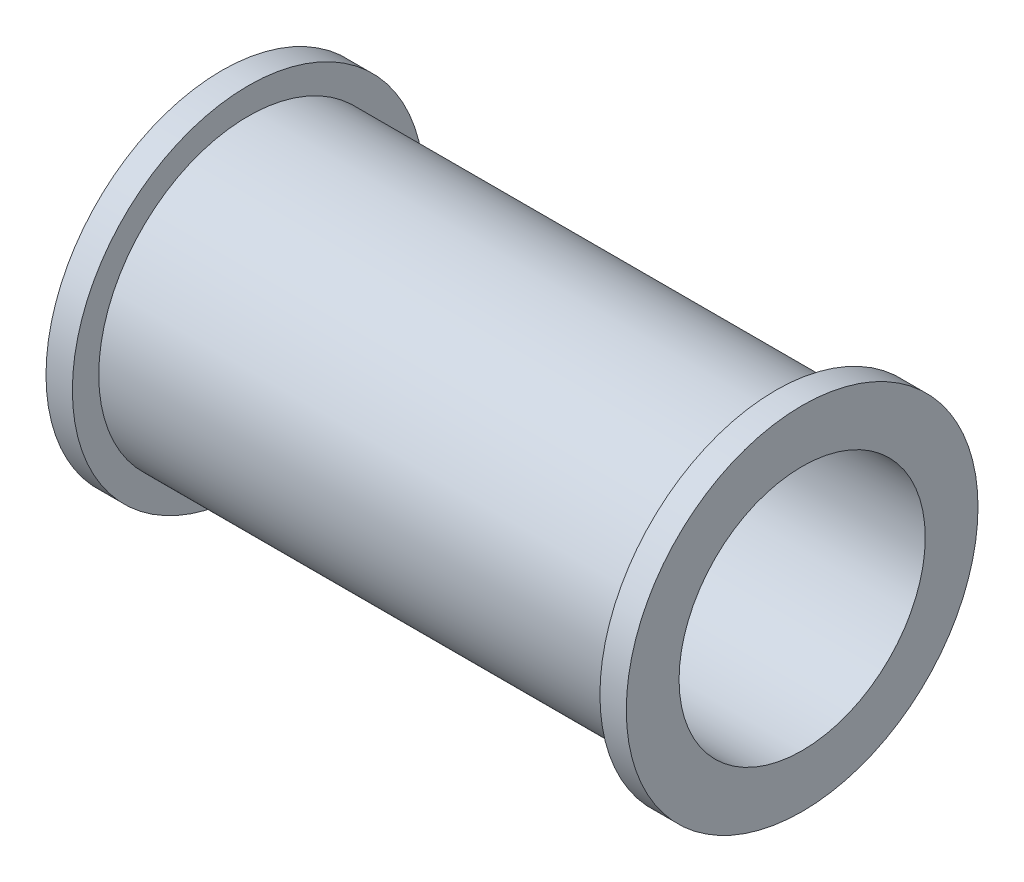
ISO-10303-21;
HEADER;
FILE_DESCRIPTION(('STEP AP214'),'2;1');
FILE_NAME('part.step','',(''),(''),'','','');
FILE_SCHEMA(('AUTOMOTIVE_DESIGN { 1 0 10303 214 1 1 1 1 }'));
ENDSEC;
DATA;
#1=APPLICATION_CONTEXT('core data for automotive mechanical design processes');
#2=APPLICATION_PROTOCOL_DEFINITION('international standard','automotive_design',2000,#1);
#3=PRODUCT_CONTEXT('',#1,'mechanical');
#4=PRODUCT('Part','Part','',(#3));
#5=PRODUCT_RELATED_PRODUCT_CATEGORY('part','',(#4));
#6=PRODUCT_DEFINITION_FORMATION('','',#4);
#7=PRODUCT_DEFINITION_CONTEXT('part definition',#1,'design');
#8=PRODUCT_DEFINITION('design','',#6,#7);
#9=PRODUCT_DEFINITION_SHAPE('','',#8);
#10=(LENGTH_UNIT() NAMED_UNIT(*) SI_UNIT(.MILLI.,.METRE.));
#11=(NAMED_UNIT(*) PLANE_ANGLE_UNIT() SI_UNIT($,.RADIAN.));
#12=(NAMED_UNIT(*) SI_UNIT($,.STERADIAN.) SOLID_ANGLE_UNIT());
#13=UNCERTAINTY_MEASURE_WITH_UNIT(LENGTH_MEASURE(1.E-05),#10,'distance_accuracy_value','');
#14=(GEOMETRIC_REPRESENTATION_CONTEXT(3) GLOBAL_UNCERTAINTY_ASSIGNED_CONTEXT((#13)) GLOBAL_UNIT_ASSIGNED_CONTEXT((#10,
#11,#12)) REPRESENTATION_CONTEXT('',''));
#15=CARTESIAN_POINT('',(0.,0.,0.));
#16=DIRECTION('',(0.,0.,1.));
#17=DIRECTION('',(1.,0.,0.));
#18=AXIS2_PLACEMENT_3D('',#15,#16,#17);
#19=CARTESIAN_POINT('',(0.,0.,0.));
#20=DIRECTION('',(-1.,0.,0.));
#21=DIRECTION('',(0.,0.,1.));
#22=AXIS2_PLACEMENT_3D('',#19,#20,#21);
#23=PLANE('',#22);
#24=CARTESIAN_POINT('',(0.,0.,0.));
#25=DIRECTION('',(1.,0.,0.));
#26=DIRECTION('',(0.,0.,-1.));
#27=AXIS2_PLACEMENT_3D('',#24,#25,#26);
#28=CIRCLE('',#27,7.);
#29=CARTESIAN_POINT('',(0.,0.,-7.));
#30=VERTEX_POINT('',#29);
#31=EDGE_CURVE('E60',#30,#30,#28,.T.);
#32=ORIENTED_EDGE('',*,*,#31,.T.);
#33=EDGE_LOOP('',(#32));
#34=FACE_BOUND('',#33,.T.);
#35=CARTESIAN_POINT('',(0.,0.,0.));
#36=DIRECTION('',(1.,0.,0.));
#37=DIRECTION('',(0.,0.,-1.));
#38=AXIS2_PLACEMENT_3D('',#35,#36,#37);
#39=CIRCLE('',#38,10.);
#40=CARTESIAN_POINT('',(0.,0.,-10.));
#41=VERTEX_POINT('',#40);
#42=EDGE_CURVE('E10',#41,#41,#39,.T.);
#43=ORIENTED_EDGE('',*,*,#42,.F.);
#44=EDGE_LOOP('',(#43));
#45=FACE_BOUND('',#44,.T.);
#46=ADVANCED_FACE('F35',(#34,#45),#23,.T.);
#47=CARTESIAN_POINT('',(33.,0.,0.));
#48=DIRECTION('',(1.,0.,0.));
#49=DIRECTION('',(0.,0.,-1.));
#50=AXIS2_PLACEMENT_3D('',#47,#48,#49);
#51=CYLINDRICAL_SURFACE('',#50,10.);
#52=ORIENTED_EDGE('',*,*,#42,.T.);
#53=EDGE_LOOP('',(#52));
#54=FACE_BOUND('',#53,.T.);
#55=CARTESIAN_POINT('',(1.5,0.,0.));
#56=DIRECTION('',(1.,0.,0.));
#57=DIRECTION('',(0.,0.,-1.));
#58=AXIS2_PLACEMENT_3D('',#55,#56,#57);
#59=CIRCLE('',#58,10.);
#60=CARTESIAN_POINT('',(1.5,0.,-10.));
#61=VERTEX_POINT('',#60);
#62=EDGE_CURVE('E41',#61,#61,#59,.T.);
#63=ORIENTED_EDGE('',*,*,#62,.F.);
#64=EDGE_LOOP('',(#63));
#65=FACE_BOUND('',#64,.T.);
#66=ADVANCED_FACE('F93',(#54,#65),#51,.T.);
#67=CARTESIAN_POINT('',(1.5,0.,-10.));
#68=DIRECTION('',(1.,0.,0.));
#69=DIRECTION('',(0.,0.,-1.));
#70=AXIS2_PLACEMENT_3D('',#67,#68,#69);
#71=PLANE('',#70);
#72=ORIENTED_EDGE('',*,*,#62,.T.);
#73=EDGE_LOOP('',(#72));
#74=FACE_BOUND('',#73,.T.);
#75=CARTESIAN_POINT('',(1.5,0.,0.));
#76=DIRECTION('',(1.,0.,0.));
#77=DIRECTION('',(0.,0.,-1.));
#78=AXIS2_PLACEMENT_3D('',#75,#76,#77);
#79=CIRCLE('',#78,8.5);
#80=CARTESIAN_POINT('',(1.5,0.,-8.5));
#81=VERTEX_POINT('',#80);
#82=EDGE_CURVE('E45',#81,#81,#79,.T.);
#83=ORIENTED_EDGE('',*,*,#82,.F.);
#84=EDGE_LOOP('',(#83));
#85=FACE_BOUND('',#84,.T.);
#86=ADVANCED_FACE('F97',(#74,#85),#71,.T.);
#87=CARTESIAN_POINT('',(33.,0.,0.));
#88=DIRECTION('',(1.,0.,0.));
#89=DIRECTION('',(0.,0.,-1.));
#90=AXIS2_PLACEMENT_3D('',#87,#88,#89);
#91=CYLINDRICAL_SURFACE('',#90,8.5);
#92=ORIENTED_EDGE('',*,*,#82,.T.);
#93=EDGE_LOOP('',(#92));
#94=FACE_BOUND('',#93,.T.);
#95=CARTESIAN_POINT('',(31.5,0.,0.));
#96=DIRECTION('',(1.,0.,0.));
#97=DIRECTION('',(0.,0.,-1.));
#98=AXIS2_PLACEMENT_3D('',#95,#96,#97);
#99=CIRCLE('',#98,8.5);
#100=CARTESIAN_POINT('',(31.5,0.,-8.5));
#101=VERTEX_POINT('',#100);
#102=EDGE_CURVE('E49',#101,#101,#99,.T.);
#103=ORIENTED_EDGE('',*,*,#102,.F.);
#104=EDGE_LOOP('',(#103));
#105=FACE_BOUND('',#104,.T.);
#106=ADVANCED_FACE('F89',(#94,#105),#91,.T.);
#107=CARTESIAN_POINT('',(31.5,0.,-10.));
#108=DIRECTION('',(-1.,0.,0.));
#109=DIRECTION('',(0.,0.,1.));
#110=AXIS2_PLACEMENT_3D('',#107,#108,#109);
#111=PLANE('',#110);
#112=ORIENTED_EDGE('',*,*,#102,.T.);
#113=EDGE_LOOP('',(#112));
#114=FACE_BOUND('',#113,.T.);
#115=CARTESIAN_POINT('',(31.5,0.,0.));
#116=DIRECTION('',(1.,0.,0.));
#117=DIRECTION('',(0.,0.,-1.));
#118=AXIS2_PLACEMENT_3D('',#115,#116,#117);
#119=CIRCLE('',#118,10.);
#120=CARTESIAN_POINT('',(31.5,0.,-10.));
#121=VERTEX_POINT('',#120);
#122=EDGE_CURVE('E54',#121,#121,#119,.T.);
#123=ORIENTED_EDGE('',*,*,#122,.F.);
#124=EDGE_LOOP('',(#123));
#125=FACE_BOUND('',#124,.T.);
#126=ADVANCED_FACE('F83',(#114,#125),#111,.T.);
#127=CARTESIAN_POINT('',(33.,0.,0.));
#128=DIRECTION('',(1.,0.,0.));
#129=DIRECTION('',(0.,0.,-1.));
#130=AXIS2_PLACEMENT_3D('',#127,#128,#129);
#131=CYLINDRICAL_SURFACE('',#130,10.);
#132=ORIENTED_EDGE('',*,*,#122,.T.);
#133=EDGE_LOOP('',(#132));
#134=FACE_BOUND('',#133,.T.);
#135=CARTESIAN_POINT('',(33.,0.,0.));
#136=DIRECTION('',(1.,0.,0.));
#137=DIRECTION('',(0.,0.,-1.));
#138=AXIS2_PLACEMENT_3D('',#135,#136,#137);
#139=CIRCLE('',#138,10.);
#140=CARTESIAN_POINT('',(33.,0.,-10.));
#141=VERTEX_POINT('',#140);
#142=EDGE_CURVE('E57',#141,#141,#139,.T.);
#143=ORIENTED_EDGE('',*,*,#142,.F.);
#144=EDGE_LOOP('',(#143));
#145=FACE_BOUND('',#144,.T.);
#146=ADVANCED_FACE('F78',(#134,#145),#131,.T.);
#147=CARTESIAN_POINT('',(33.,0.,0.));
#148=DIRECTION('',(1.,0.,0.));
#149=DIRECTION('',(0.,0.,-1.));
#150=AXIS2_PLACEMENT_3D('',#147,#148,#149);
#151=PLANE('',#150);
#152=CARTESIAN_POINT('',(33.,0.,0.));
#153=DIRECTION('',(1.,0.,0.));
#154=DIRECTION('',(0.,0.,-1.));
#155=AXIS2_PLACEMENT_3D('',#152,#153,#154);
#156=CIRCLE('',#155,7.);
#157=CARTESIAN_POINT('',(33.,0.,-7.));
#158=VERTEX_POINT('',#157);
#159=EDGE_CURVE('E61',#158,#158,#156,.T.);
#160=ORIENTED_EDGE('',*,*,#159,.F.);
#161=EDGE_LOOP('',(#160));
#162=FACE_BOUND('',#161,.T.);
#163=ORIENTED_EDGE('',*,*,#142,.T.);
#164=EDGE_LOOP('',(#163));
#165=FACE_BOUND('',#164,.T.);
#166=ADVANCED_FACE('F72',(#162,#165),#151,.T.);
#167=CARTESIAN_POINT('',(0.,0.,0.));
#168=DIRECTION('',(1.,0.,0.));
#169=DIRECTION('',(0.,0.,-1.));
#170=AXIS2_PLACEMENT_3D('',#167,#168,#169);
#171=CYLINDRICAL_SURFACE('',#170,7.);
#172=ORIENTED_EDGE('',*,*,#31,.F.);
#173=EDGE_LOOP('',(#172));
#174=FACE_BOUND('',#173,.T.);
#175=ORIENTED_EDGE('',*,*,#159,.T.);
#176=EDGE_LOOP('',(#175));
#177=FACE_BOUND('',#176,.T.);
#178=ADVANCED_FACE('F69',(#174,#177),#171,.F.);
#179=CLOSED_SHELL('',(#46,#66,#86,#106,#126,#146,#166,#178));
#180=MANIFOLD_SOLID_BREP('B2',#179);
#181=ADVANCED_BREP_SHAPE_REPRESENTATION('',(#18,#180),#14);
#182=SHAPE_DEFINITION_REPRESENTATION(#9,#181);
ENDSEC;
END-ISO-10303-21;
